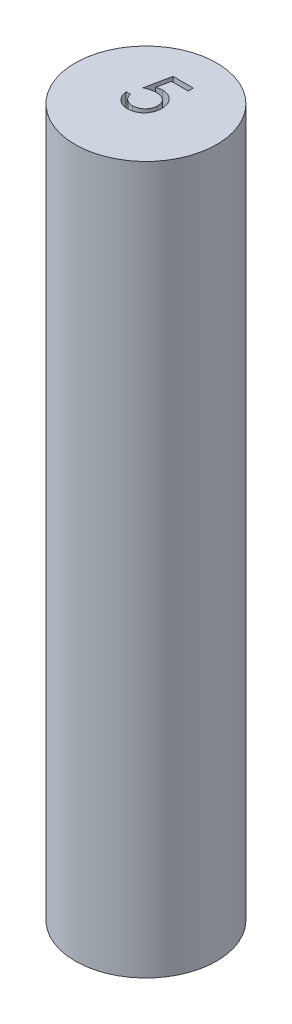
ISO-10303-21;
HEADER;
FILE_DESCRIPTION(('STEP AP214'),'2;1');
FILE_NAME('part.step','',(''),(''),'','','');
FILE_SCHEMA(('AUTOMOTIVE_DESIGN { 1 0 10303 214 1 1 1 1 }'));
ENDSEC;
DATA;
#1=APPLICATION_CONTEXT('core data for automotive mechanical design processes');
#2=APPLICATION_PROTOCOL_DEFINITION('international standard','automotive_design',2000,#1);
#3=PRODUCT_CONTEXT('',#1,'mechanical');
#4=PRODUCT('Part','Part','',(#3));
#5=PRODUCT_RELATED_PRODUCT_CATEGORY('part','',(#4));
#6=PRODUCT_DEFINITION_FORMATION('','',#4);
#7=PRODUCT_DEFINITION_CONTEXT('part definition',#1,'design');
#8=PRODUCT_DEFINITION('design','',#6,#7);
#9=PRODUCT_DEFINITION_SHAPE('','',#8);
#10=(LENGTH_UNIT() NAMED_UNIT(*) SI_UNIT(.MILLI.,.METRE.));
#11=(NAMED_UNIT(*) PLANE_ANGLE_UNIT() SI_UNIT($,.RADIAN.));
#12=(NAMED_UNIT(*) SI_UNIT($,.STERADIAN.) SOLID_ANGLE_UNIT());
#13=UNCERTAINTY_MEASURE_WITH_UNIT(LENGTH_MEASURE(1.E-05),#10,'distance_accuracy_value','');
#14=(GEOMETRIC_REPRESENTATION_CONTEXT(3) GLOBAL_UNCERTAINTY_ASSIGNED_CONTEXT((#13)) GLOBAL_UNIT_ASSIGNED_CONTEXT((#10,
#11,#12)) REPRESENTATION_CONTEXT('',''));
#15=CARTESIAN_POINT('',(0.,0.,0.));
#16=DIRECTION('',(0.,0.,1.));
#17=DIRECTION('',(1.,0.,0.));
#18=AXIS2_PLACEMENT_3D('',#15,#16,#17);
#19=CARTESIAN_POINT('',(0.,50.,0.));
#20=DIRECTION('',(0.,1.,0.));
#21=DIRECTION('',(0.,0.,1.));
#22=AXIS2_PLACEMENT_3D('',#19,#20,#21);
#23=PLANE('',#22);
#24=CARTESIAN_POINT('',(0.,50.,0.));
#25=DIRECTION('',(0.,1.,0.));
#26=DIRECTION('',(0.,0.,1.));
#27=AXIS2_PLACEMENT_3D('',#24,#25,#26);
#28=CIRCLE('',#27,5.);
#29=CARTESIAN_POINT('',(0.,50.,5.));
#30=VERTEX_POINT('',#29);
#31=EDGE_CURVE('E11',#30,#30,#28,.T.);
#32=ORIENTED_EDGE('',*,*,#31,.T.);
#33=EDGE_LOOP('',(#32));
#34=FACE_BOUND('',#33,.T.);
#35=DIRECTION('',(0.200944143721331,0.,-0.97960270064149));
#36=VECTOR('',#35,1.);
#37=CARTESIAN_POINT('',(-1.07623659228629,50.,-0.881935528420076));
#38=LINE('',#37,#36);
#39=CARTESIAN_POINT('',(-1.07623659228629,50.,-0.881935528420076));
#40=VERTEX_POINT('',#39);
#41=CARTESIAN_POINT('',(-0.717262233311934,50.,-2.63193552842008));
#42=VERTEX_POINT('',#41);
#43=EDGE_CURVE('E279',#40,#42,#38,.T.);
#44=ORIENTED_EDGE('',*,*,#43,.T.);
#45=DIRECTION('',(1.,0.,0.));
#46=VECTOR('',#45,1.);
#47=CARTESIAN_POINT('',(-0.717262233311933,50.,-2.63193552842008));
#48=LINE('',#47,#46);
#49=CARTESIAN_POINT('',(0.718635202585503,50.,-2.63193552842008));
#50=VERTEX_POINT('',#49);
#51=EDGE_CURVE('E55',#42,#50,#48,.T.);
#52=ORIENTED_EDGE('',*,*,#51,.T.);
#53=DIRECTION('',(0.,0.,1.));
#54=VECTOR('',#53,1.);
#55=CARTESIAN_POINT('',(0.718635202585503,50.,-2.63193552842008));
#56=LINE('',#55,#54);
#57=CARTESIAN_POINT('',(0.718635202585503,50.,-2.27296116944572));
#58=VERTEX_POINT('',#57);
#59=EDGE_CURVE('E376',#50,#58,#56,.T.);
#60=ORIENTED_EDGE('',*,*,#59,.T.);
#61=DIRECTION('',(-1.,0.,0.));
#62=VECTOR('',#61,1.);
#63=CARTESIAN_POINT('',(0.718635202585503,50.,-2.27296116944572));
#64=LINE('',#63,#62);
#65=CARTESIAN_POINT('',(-0.471869605106805,50.,-2.27296116944572));
#66=VERTEX_POINT('',#65);
#67=EDGE_CURVE('E372',#58,#66,#64,.T.);
#68=ORIENTED_EDGE('',*,*,#67,.T.);
#69=DIRECTION('',(-0.200705474463135,0.,0.979651628141621));
#70=VECTOR('',#69,1.);
#71=CARTESIAN_POINT('',(-0.471869605106805,50.,-2.27296116944572));
#72=LINE('',#71,#70);
#73=CARTESIAN_POINT('',(-0.660471367927318,50.,-1.35238825277905));
#74=VERTEX_POINT('',#73);
#75=EDGE_CURVE('E364',#66,#74,#72,.T.);
#76=ORIENTED_EDGE('',*,*,#75,.T.);
#77=CARTESIAN_POINT('',(-0.660471367927318,50.,-1.35238825277905));
#78=CARTESIAN_POINT('',(-0.62341549355365,50.,-1.36261852458931));
#79=CARTESIAN_POINT('',(-0.551625597721274,50.,-1.38243805819927));
#80=CARTESIAN_POINT('',(-0.445665736757551,50.,-1.40444382862876));
#81=CARTESIAN_POINT('',(-0.34507353328656,50.,-1.41770927268624));
#82=CARTESIAN_POINT('',(-0.279798162876054,50.,-1.41952058319843));
#83=CARTESIAN_POINT('',(-0.248211752542703,50.,-1.42039706688161));
#84=B_SPLINE_CURVE_WITH_KNOTS('',3,(#77,#78,#79,#80,#81,#82,#83),.UNSPECIFIED.,.F.,.F.,(4,1,1,1,
4),(0.,0.275068369018743,0.532901460089936,0.773973459592445,1.),.UNSPECIFIED.);
#85=CARTESIAN_POINT('',(-0.248211752542703,50.,-1.42039706688161));
#86=VERTEX_POINT('',#85);
#87=EDGE_CURVE('E371',#74,#86,#84,.T.);
#88=ORIENTED_EDGE('',*,*,#87,.T.);
#89=CARTESIAN_POINT('',(-0.248211752542703,50.,-1.42039706688161));
#90=CARTESIAN_POINT('',(-0.209128012830501,50.,-1.41955113118697));
#91=CARTESIAN_POINT('',(-0.132279615505371,50.,-1.41788781025474));
#92=CARTESIAN_POINT('',(-0.0198406685117425,50.,-1.40191596081044));
#93=CARTESIAN_POINT('',(0.0874922247063756,50.,-1.37677604618019));
#94=CARTESIAN_POINT('',(0.189494594882724,50.,-1.34165552444349));
#95=CARTESIAN_POINT('',(0.286355145520003,50.,-1.29674579124916));
#96=CARTESIAN_POINT('',(0.377182707000526,50.,-1.24064585089134));
#97=CARTESIAN_POINT('',(0.463340619987352,50.,-1.17511251974169));
#98=CARTESIAN_POINT('',(0.543283213941527,50.,-1.09976750778208));
#99=CARTESIAN_POINT('',(0.615807522106947,50.,-1.01684589102991));
#100=CARTESIAN_POINT('',(0.679573511773929,50.,-0.927688019986427));
#101=CARTESIAN_POINT('',(0.733736102078204,50.,-0.83316035785185));
#102=CARTESIAN_POINT('',(0.777296856954626,50.,-0.732359749113633));
#103=CARTESIAN_POINT('',(0.812081191230572,50.,-0.62640059570326));
#104=CARTESIAN_POINT('',(0.835233186074378,50.,-0.514168013151016));
#105=CARTESIAN_POINT('',(0.850649895035669,50.,-0.396719893137636));
#106=CARTESIAN_POINT('',(0.852372281355253,50.,-0.316415323060459));
#107=CARTESIAN_POINT('',(0.853250587200887,50.,-0.275465175855973));
#108=B_SPLINE_CURVE_WITH_KNOTS('',3,(#89,#90,#91,#92,#93,#94,#95,#96,#97,#98,#99,#100,#101,#102,
#103,#104,#105,#106,#107),.UNSPECIFIED.,.F.,.F.,(4,1,1,1,1,1,1,1,1,1,1,1,1,1,1,1,4),(0.,
0.0658076458106948,0.129394273668056,0.19089406063219,0.251281068929836,0.310814964465273,
0.370370987448245,0.430768262589727,0.492881250617502,0.55510394815525,0.616067050993843,
0.677256033174654,0.738259805199117,0.800762134376296,0.864777581574485,0.931045294999404,1.),.UNSPECIFIED.);
#109=CARTESIAN_POINT('',(0.853250587200887,50.,-0.275465175855973));
#110=VERTEX_POINT('',#109);
#111=EDGE_CURVE('E387',#86,#110,#108,.T.);
#112=ORIENTED_EDGE('',*,*,#111,.T.);
#113=CARTESIAN_POINT('',(0.853250587200887,50.,-0.275465175855973));
#114=CARTESIAN_POINT('',(0.852585511927517,50.,-0.246942955504013));
#115=CARTESIAN_POINT('',(0.851264349297613,50.,-0.190283967928169));
#116=CARTESIAN_POINT('',(0.844545761649825,50.,-0.106139767242871));
#117=CARTESIAN_POINT('',(0.831610045585646,50.,-0.0237769341605294));
#118=CARTESIAN_POINT('',(0.814242321481598,50.,0.0568154576781773));
#119=CARTESIAN_POINT('',(0.791699903516092,50.,0.1354848298573));
#120=CARTESIAN_POINT('',(0.764410849613766,50.,0.212456357784072));
#121=CARTESIAN_POINT('',(0.731014822103908,50.,0.287250964527232));
#122=CARTESIAN_POINT('',(0.694383446844984,50.,0.360576359551009));
#123=CARTESIAN_POINT('',(0.653136968809668,50.,0.430774866745728));
#124=CARTESIAN_POINT('',(0.607358461470707,50.,0.496423853288414));
#125=CARTESIAN_POINT('',(0.558992970248379,50.,0.558508134768357));
#126=CARTESIAN_POINT('',(0.506951584790099,50.,0.616361867777545));
#127=CARTESIAN_POINT('',(0.450750589677504,50.,0.669604885670543));
#128=CARTESIAN_POINT('',(0.391070622815796,50.,0.718553167176471));
#129=CARTESIAN_POINT('',(0.32838790378667,50.,0.764034497479565));
#130=CARTESIAN_POINT('',(0.261732661465713,50.,0.804202692655071));
#131=CARTESIAN_POINT('',(0.192590178502148,50.,0.841165648807863));
#132=CARTESIAN_POINT('',(0.119961961361665,50.,0.871489186143206));
#133=CARTESIAN_POINT('',(0.0455012609041593,50.,0.898599714228155));
#134=CARTESIAN_POINT('',(-0.0318636146906746,50.,0.920209241839751));
#135=CARTESIAN_POINT('',(-0.111957427306437,50.,0.937141796359078));
#136=CARTESIAN_POINT('',(-0.194912202788528,50.,0.948642396961549));
#137=CARTESIAN_POINT('',(-0.280292872812277,50.,0.957018834431784));
#138=CARTESIAN_POINT('',(-0.338167885392149,50.,0.957543191382416));
#139=CARTESIAN_POINT('',(-0.367402457670908,50.,0.957808061323514));
#140=B_SPLINE_CURVE_WITH_KNOTS('',3,(#113,#114,#115,#116,#117,#118,#119,#120,#121,#122,#123,
#124,#125,#126,#127,#128,#129,#130,#131,#132,#133,#134,#135,#136,#137,#138,#139),.UNSPECIFIED.,
.F.,.F.,(4,1,1,1,1,1,1,1,1,1,1,1,1,1,1,1,1,1,1,1,1,1,1,1,4),(0.,0.04401447057614,
0.0874341236677057,0.130118398657898,0.172553694558183,0.214554755968139,0.256298092097131,
0.29843822513325,0.340849002588096,0.382715188967027,0.423924045407532,0.464246243250418,
0.504073671461796,0.543861905868491,0.583566724979654,0.623094318852334,0.663229060768585,
0.70355125861147,0.743937894686185,0.784541254800093,0.825750111240597,0.867757363388507,
0.91074516403231,0.954914446891478,1.),.UNSPECIFIED.);
#141=CARTESIAN_POINT('',(-0.367402457670908,50.,0.957808061323514));
#142=VERTEX_POINT('',#141);
#143=EDGE_CURVE('E396',#110,#142,#140,.T.);
#144=ORIENTED_EDGE('',*,*,#143,.T.);
#145=CARTESIAN_POINT('',(-0.367402457670908,50.,0.957808061323514));
#146=CARTESIAN_POINT('',(-0.402276638373117,50.,0.957117223339353));
#147=CARTESIAN_POINT('',(-0.470887469077004,50.,0.955758081216996));
#148=CARTESIAN_POINT('',(-0.571408036148568,50.,0.941539595962919));
#149=CARTESIAN_POINT('',(-0.66812264184203,50.,0.921175679570378));
#150=CARTESIAN_POINT('',(-0.760252742999452,50.,0.890539409722026));
#151=CARTESIAN_POINT('',(-0.84862400670469,50.,0.852152115031805));
#152=CARTESIAN_POINT('',(-0.932046724493541,50.,0.803635943536381));
#153=CARTESIAN_POINT('',(-1.01265250054141,50.,0.748656839789333));
#154=CARTESIAN_POINT('',(-1.08716453729091,50.,0.683776486824548));
#155=CARTESIAN_POINT('',(-1.15632065076056,50.,0.612860804792037));
#156=CARTESIAN_POINT('',(-1.21822715963089,50.,0.535903163626293));
#157=CARTESIAN_POINT('',(-1.27336073636755,50.,0.454173721540196));
#158=CARTESIAN_POINT('',(-1.3208384833564,50.,0.367275567464477));
#159=CARTESIAN_POINT('',(-1.36133650467279,50.,0.27543703652684));
#160=CARTESIAN_POINT('',(-1.3931514929495,50.,0.178314035634898));
#161=CARTESIAN_POINT('',(-1.41882984789262,50.,0.0764140316954972));
#162=CARTESIAN_POINT('',(-1.42969326836897,50.,0.00626052128496388));
#163=CARTESIAN_POINT('',(-1.43521095126065,50.,-0.0293714258559734));
#164=B_SPLINE_CURVE_WITH_KNOTS('',3,(#145,#146,#147,#148,#149,#150,#151,#152,#153,#154,#155,
#156,#157,#158,#159,#160,#161,#162,#163),.UNSPECIFIED.,.F.,.F.,(4,1,1,1,1,1,1,1,1,1,1,1,1,1,1,1,
4),(0.,0.0654211437588925,0.128708371881883,0.190236141863538,0.250724402033539,
0.310637179413444,0.370766408289727,0.431614744412353,0.493522973566354,0.555883455377533,
0.61734236731851,0.678668039097275,0.740711359545148,0.802985362512745,0.866802580265518,
0.932347171345888,1.),.UNSPECIFIED.);
#165=CARTESIAN_POINT('',(-1.43521095126065,50.,-0.0293714258559734));
#166=VERTEX_POINT('',#165);
#167=EDGE_CURVE('E405',#142,#166,#164,.T.);
#168=ORIENTED_EDGE('',*,*,#167,.T.);
#169=DIRECTION('',(1.,0.,0.));
#170=VECTOR('',#169,1.);
#171=CARTESIAN_POINT('',(-1.43521095126065,50.,-0.0293714258559734));
#172=LINE('',#171,#170);
#173=CARTESIAN_POINT('',(-1.12110838715809,50.,-0.0293714258559734));
#174=VERTEX_POINT('',#173);
#175=EDGE_CURVE('E414',#166,#174,#172,.T.);
#176=ORIENTED_EDGE('',*,*,#175,.T.);
#177=CARTESIAN_POINT('',(-1.12110838715809,50.,-0.0293714258559734));
#178=CARTESIAN_POINT('',(-1.11337982976792,50.,0.00400502659267852));
#179=CARTESIAN_POINT('',(-1.09852511332705,50.,0.0681564214646408));
#180=CARTESIAN_POINT('',(-1.06591936457507,50.,0.158287762797713));
#181=CARTESIAN_POINT('',(-1.02605348910235,50.,0.238606986473723));
#182=CARTESIAN_POINT('',(-0.978649140685077,50.,0.31017656974727));
#183=CARTESIAN_POINT('',(-0.922099110198855,50.,0.37258556701958));
#184=CARTESIAN_POINT('',(-0.857569681258205,50.,0.428202628957347));
#185=CARTESIAN_POINT('',(-0.785221958058977,50.,0.478377758284881));
#186=CARTESIAN_POINT('',(-0.704828728539082,50.,0.520200525482194));
#187=CARTESIAN_POINT('',(-0.620015649218712,50.,0.555869278882219));
#188=CARTESIAN_POINT('',(-0.531248439209124,50.,0.57962097383389));
#189=CARTESIAN_POINT('',(-0.440944092738035,50.,0.596321866676701));
#190=CARTESIAN_POINT('',(-0.379865722541538,50.,0.597993627478355));
#191=CARTESIAN_POINT('',(-0.349173291004241,50.,0.598833702349155));
#192=B_SPLINE_CURVE_WITH_KNOTS('',3,(#177,#178,#179,#180,#181,#182,#183,#184,#185,#186,#187,
#188,#189,#190,#191),.UNSPECIFIED.,.F.,.F.,(4,1,1,1,1,1,1,1,1,1,1,1,4),(0.,0.0946872518675539,
0.181994155707275,0.264376948610512,0.342179861947772,0.418617610862147,0.496509075371909,
0.577369091611732,0.661510592454198,0.746732550829197,0.831257984327743,0.915205616213655,1.),.UNSPECIFIED.);
#193=CARTESIAN_POINT('',(-0.349173291004241,50.,0.598833702349155));
#194=VERTEX_POINT('',#193);
#195=EDGE_CURVE('E421',#174,#194,#192,.T.);
#196=ORIENTED_EDGE('',*,*,#195,.T.);
#197=CARTESIAN_POINT('',(-0.349173291004241,50.,0.598833702349155));
#198=CARTESIAN_POINT('',(-0.319214846586953,50.,0.598012924444051));
#199=CARTESIAN_POINT('',(-0.260226424398379,50.,0.596396806032998));
#200=CARTESIAN_POINT('',(-0.173415037705375,50.,0.583957793943144));
#201=CARTESIAN_POINT('',(-0.0896021635032361,50.,0.564800222635528));
#202=CARTESIAN_POINT('',(-0.00961480674427134,50.,0.536130367651756));
#203=CARTESIAN_POINT('',(0.067946732844773,50.,0.501285649225945));
#204=CARTESIAN_POINT('',(0.141120503267869,50.,0.456570573410066));
#205=CARTESIAN_POINT('',(0.212023380408537,50.,0.405110554965058));
#206=CARTESIAN_POINT('',(0.27845151392959,50.,0.346153924921672));
#207=CARTESIAN_POINT('',(0.339290963189144,50.,0.28118423030242));
#208=CARTESIAN_POINT('',(0.393047084323063,50.,0.211706836877508));
#209=CARTESIAN_POINT('',(0.437823997749215,50.,0.137589990334633));
#210=CARTESIAN_POINT('',(0.475558106618903,50.,0.060116837483714));
#211=CARTESIAN_POINT('',(0.504211405441535,50.,-0.021561719694731));
#212=CARTESIAN_POINT('',(0.524652386664338,50.,-0.107062894867154));
#213=CARTESIAN_POINT('',(0.536655445482834,50.,-0.196597875073582));
#214=CARTESIAN_POINT('',(0.538306625454802,50.,-0.257667184849802));
#215=CARTESIAN_POINT('',(0.539148023098323,50.,-0.288786489958537));
#216=B_SPLINE_CURVE_WITH_KNOTS('',3,(#197,#198,#199,#200,#201,#202,#203,#204,#205,#206,#207,
#208,#209,#210,#211,#212,#213,#214,#215),.UNSPECIFIED.,.F.,.F.,(4,1,1,1,1,1,1,1,1,1,1,1,1,1,1,1,
4),(0.,0.0642072952829856,0.126424689779743,0.187680284264922,0.248216424455213,
0.308305060008613,0.369660991325143,0.43169855178678,0.495946892208764,0.55975802397212,
0.622295407826159,0.683910635284174,0.745092408056624,0.806740225389293,0.869086618121202,
0.933290002974799,1.),.UNSPECIFIED.);
#217=CARTESIAN_POINT('',(0.539148023098323,50.,-0.288786489958537));
#218=VERTEX_POINT('',#217);
#219=EDGE_CURVE('E427',#194,#218,#216,.T.);
#220=ORIENTED_EDGE('',*,*,#219,.T.);
#221=CARTESIAN_POINT('',(0.539148023098323,50.,-0.288786489958537));
#222=CARTESIAN_POINT('',(0.538489543636872,50.,-0.316862241579735));
#223=CARTESIAN_POINT('',(0.537200663782479,50.,-0.371816530634923));
#224=CARTESIAN_POINT('',(0.526670093479521,50.,-0.452215737076165));
#225=CARTESIAN_POINT('',(0.50835312112582,50.,-0.528288779377761));
#226=CARTESIAN_POINT('',(0.48292924117886,50.,-0.600403013349724));
#227=CARTESIAN_POINT('',(0.450649733445259,50.,-0.668626455697758));
#228=CARTESIAN_POINT('',(0.411203421126436,50.,-0.733029515897957));
#229=CARTESIAN_POINT('',(0.363850023182933,50.,-0.792763349121439));
#230=CARTESIAN_POINT('',(0.309758134594269,50.,-0.847855902730945));
#231=CARTESIAN_POINT('',(0.250500093651186,50.,-0.898700777604049));
#232=CARTESIAN_POINT('',(0.185056351054059,50.,-0.942044864055998));
#233=CARTESIAN_POINT('',(0.11479642425891,50.,-0.978508781707828));
#234=CARTESIAN_POINT('',(0.0405668247900537,50.,-1.00997678005059));
#235=CARTESIAN_POINT('',(-0.039398073797348,50.,-1.03257752544993));
#236=CARTESIAN_POINT('',(-0.123514706176746,50.,-1.04954541089203));
#237=CARTESIAN_POINT('',(-0.212691414123702,50.,-1.05936077357029));
#238=CARTESIAN_POINT('',(-0.273662102257656,50.,-1.06072266194604));
#239=CARTESIAN_POINT('',(-0.305002617927318,50.,-1.06142270790726));
#240=B_SPLINE_CURVE_WITH_KNOTS('',3,(#221,#222,#223,#224,#225,#226,#227,#228,#229,#230,#231,
#232,#233,#234,#235,#236,#237,#238,#239),.UNSPECIFIED.,.F.,.F.,(4,1,1,1,1,1,1,1,1,1,1,1,1,1,1,1,
4),(0.,0.0653513820265936,0.127916031830613,0.1883602055717,0.247216077265452,0.305630129197411,
0.363769839831819,0.42266091391278,0.482687294090392,0.543300221239559,0.604117955323103,
0.664964891265284,0.727413494112565,0.791467625149424,0.8580554427291,0.927036814614948,1.),.UNSPECIFIED.);
#241=CARTESIAN_POINT('',(-0.305002617927318,50.,-1.06142270790726));
#242=VERTEX_POINT('',#241);
#243=EDGE_CURVE('E286',#218,#242,#240,.T.);
#244=ORIENTED_EDGE('',*,*,#243,.T.);
#245=CARTESIAN_POINT('',(-0.305002617927318,50.,-1.06142270790726));
#246=CARTESIAN_POINT('',(-0.332131546733742,50.,-1.06084211674967));
#247=CARTESIAN_POINT('',(-0.388145902058445,50.,-1.05964334330634));
#248=CARTESIAN_POINT('',(-0.474068728787708,50.,-1.05081684648001));
#249=CARTESIAN_POINT('',(-0.564360451764435,50.,-1.03657755205187));
#250=CARTESIAN_POINT('',(-0.658674947320635,50.,-1.01699130458269));
#251=CARTESIAN_POINT('',(-0.757295455423644,50.,-0.991360227824061));
#252=CARTESIAN_POINT('',(-0.860013856150918,50.,-0.960645727198498));
#253=CARTESIAN_POINT('',(-0.967046122750207,50.,-0.923923728484904));
#254=CARTESIAN_POINT('',(-1.03916384714895,50.,-0.896191514738229));
#255=CARTESIAN_POINT('',(-1.07623659228629,50.,-0.881935528420076));
#256=B_SPLINE_CURVE_WITH_KNOTS('',3,(#245,#246,#247,#248,#249,#250,#251,#252,#253,#254,#255),
.UNSPECIFIED.,.F.,.F.,(4,1,1,1,1,1,1,1,4),(0.,0.10220303703522,0.211023342373876,
0.325099661565208,0.446502097134889,0.573787717648856,0.708900709766066,0.850357871293401,1.),.UNSPECIFIED.);
#257=EDGE_CURVE('E166',#242,#40,#256,.T.);
#258=ORIENTED_EDGE('',*,*,#257,.T.);
#259=EDGE_LOOP('',(#44,#52,#60,#68,#76,#88,#112,#144,#168,#176,#196,#220,#244,#258));
#260=FACE_BOUND('',#259,.T.);
#261=ADVANCED_FACE('F39',(#34,#260),#23,.T.);
#262=CARTESIAN_POINT('',(0.,50.,0.));
#263=DIRECTION('',(0.,-1.,0.));
#264=DIRECTION('',(0.,0.,-1.));
#265=AXIS2_PLACEMENT_3D('',#262,#263,#264);
#266=CYLINDRICAL_SURFACE('',#265,5.);
#267=ORIENTED_EDGE('',*,*,#31,.F.);
#268=EDGE_LOOP('',(#267));
#269=FACE_BOUND('',#268,.T.);
#270=CARTESIAN_POINT('',(0.,0.,0.));
#271=DIRECTION('',(0.,1.,0.));
#272=DIRECTION('',(0.,0.,1.));
#273=AXIS2_PLACEMENT_3D('',#270,#271,#272);
#274=CIRCLE('',#273,5.);
#275=CARTESIAN_POINT('',(0.,0.,5.));
#276=VERTEX_POINT('',#275);
#277=EDGE_CURVE('E43',#276,#276,#274,.T.);
#278=ORIENTED_EDGE('',*,*,#277,.T.);
#279=EDGE_LOOP('',(#278));
#280=FACE_BOUND('',#279,.T.);
#281=ADVANCED_FACE('F41',(#269,#280),#266,.T.);
#282=CARTESIAN_POINT('',(0.,0.,0.));
#283=DIRECTION('',(0.,1.,0.));
#284=DIRECTION('',(0.,0.,1.));
#285=AXIS2_PLACEMENT_3D('',#282,#283,#284);
#286=PLANE('',#285);
#287=ORIENTED_EDGE('',*,*,#277,.F.);
#288=EDGE_LOOP('',(#287));
#289=FACE_BOUND('',#288,.T.);
#290=ADVANCED_FACE('F332',(#289),#286,.F.);
#291=CARTESIAN_POINT('',(-0.717262233311933,47.,-2.63193552842008));
#292=DIRECTION('',(0.,0.,1.));
#293=DIRECTION('',(1.,0.,0.));
#294=AXIS2_PLACEMENT_3D('',#291,#292,#293);
#295=PLANE('',#294);
#296=ORIENTED_EDGE('',*,*,#51,.F.);
#297=DIRECTION('',(0.,1.,0.));
#298=VECTOR('',#297,1.);
#299=CARTESIAN_POINT('',(-0.717262233311933,47.,-2.63193552842008));
#300=LINE('',#299,#298);
#301=CARTESIAN_POINT('',(-0.717262233311933,47.,-2.63193552842008));
#302=VERTEX_POINT('',#301);
#303=EDGE_CURVE('E174',#302,#42,#300,.T.);
#304=ORIENTED_EDGE('',*,*,#303,.F.);
#305=DIRECTION('',(1.,0.,0.));
#306=VECTOR('',#305,1.);
#307=CARTESIAN_POINT('',(-0.717262233311933,47.,-2.63193552842008));
#308=LINE('',#307,#306);
#309=CARTESIAN_POINT('',(0.718635202585503,47.,-2.63193552842008));
#310=VERTEX_POINT('',#309);
#311=EDGE_CURVE('E277',#302,#310,#308,.T.);
#312=ORIENTED_EDGE('',*,*,#311,.T.);
#313=DIRECTION('',(0.,1.,0.));
#314=VECTOR('',#313,1.);
#315=CARTESIAN_POINT('',(0.718635202585503,47.,-2.63193552842008));
#316=LINE('',#315,#314);
#317=EDGE_CURVE('E325',#310,#50,#316,.T.);
#318=ORIENTED_EDGE('',*,*,#317,.T.);
#319=EDGE_LOOP('',(#296,#304,#312,#318));
#320=FACE_BOUND('',#319,.T.);
#321=ADVANCED_FACE('F334',(#320),#295,.T.);
#322=CARTESIAN_POINT('',(0.718635202585503,47.,-2.63193552842008));
#323=DIRECTION('',(-1.,0.,0.));
#324=DIRECTION('',(0.,0.,1.));
#325=AXIS2_PLACEMENT_3D('',#322,#323,#324);
#326=PLANE('',#325);
#327=ORIENTED_EDGE('',*,*,#59,.F.);
#328=ORIENTED_EDGE('',*,*,#317,.F.);
#329=DIRECTION('',(0.,0.,1.));
#330=VECTOR('',#329,1.);
#331=CARTESIAN_POINT('',(0.718635202585503,47.,-2.63193552842008));
#332=LINE('',#331,#330);
#333=CARTESIAN_POINT('',(0.718635202585503,47.,-2.27296116944572));
#334=VERTEX_POINT('',#333);
#335=EDGE_CURVE('E118',#310,#334,#332,.T.);
#336=ORIENTED_EDGE('',*,*,#335,.T.);
#337=DIRECTION('',(0.,1.,0.));
#338=VECTOR('',#337,1.);
#339=CARTESIAN_POINT('',(0.718635202585503,47.,-2.27296116944572));
#340=LINE('',#339,#338);
#341=EDGE_CURVE('E322',#334,#58,#340,.T.);
#342=ORIENTED_EDGE('',*,*,#341,.T.);
#343=EDGE_LOOP('',(#327,#328,#336,#342));
#344=FACE_BOUND('',#343,.T.);
#345=ADVANCED_FACE('F339',(#344),#326,.T.);
#346=CARTESIAN_POINT('',(0.718635202585503,47.,-2.27296116944572));
#347=DIRECTION('',(0.,0.,-1.));
#348=DIRECTION('',(-1.,0.,0.));
#349=AXIS2_PLACEMENT_3D('',#346,#347,#348);
#350=PLANE('',#349);
#351=ORIENTED_EDGE('',*,*,#67,.F.);
#352=ORIENTED_EDGE('',*,*,#341,.F.);
#353=DIRECTION('',(-1.,0.,0.));
#354=VECTOR('',#353,1.);
#355=CARTESIAN_POINT('',(0.718635202585503,47.,-2.27296116944572));
#356=LINE('',#355,#354);
#357=CARTESIAN_POINT('',(-0.471869605106805,47.,-2.27296116944572));
#358=VERTEX_POINT('',#357);
#359=EDGE_CURVE('E272',#334,#358,#356,.T.);
#360=ORIENTED_EDGE('',*,*,#359,.T.);
#361=DIRECTION('',(0.,1.,0.));
#362=VECTOR('',#361,1.);
#363=CARTESIAN_POINT('',(-0.471869605106805,47.,-2.27296116944572));
#364=LINE('',#363,#362);
#365=EDGE_CURVE('E319',#358,#66,#364,.T.);
#366=ORIENTED_EDGE('',*,*,#365,.T.);
#367=EDGE_LOOP('',(#351,#352,#360,#366));
#368=FACE_BOUND('',#367,.T.);
#369=ADVANCED_FACE('F350',(#368),#350,.T.);
#370=CARTESIAN_POINT('',(-0.471869605106805,47.,-2.27296116944572));
#371=DIRECTION('',(-0.97965162814162,0.,-0.200705474463135));
#372=DIRECTION('',(-0.200705474463135,0.,0.979651628141621));
#373=AXIS2_PLACEMENT_3D('',#370,#371,#372);
#374=PLANE('',#373);
#375=ORIENTED_EDGE('',*,*,#75,.F.);
#376=ORIENTED_EDGE('',*,*,#365,.F.);
#377=DIRECTION('',(-0.200705474463135,0.,0.979651628141621));
#378=VECTOR('',#377,1.);
#379=CARTESIAN_POINT('',(-0.471869605106805,47.,-2.27296116944572));
#380=LINE('',#379,#378);
#381=CARTESIAN_POINT('',(-0.660471367927318,47.,-1.35238825277905));
#382=VERTEX_POINT('',#381);
#383=EDGE_CURVE('E266',#358,#382,#380,.T.);
#384=ORIENTED_EDGE('',*,*,#383,.T.);
#385=DIRECTION('',(0.,1.,0.));
#386=VECTOR('',#385,1.);
#387=CARTESIAN_POINT('',(-0.660471367927318,47.,-1.35238825277905));
#388=LINE('',#387,#386);
#389=EDGE_CURVE('E316',#382,#74,#388,.T.);
#390=ORIENTED_EDGE('',*,*,#389,.T.);
#391=EDGE_LOOP('',(#375,#376,#384,#390));
#392=FACE_BOUND('',#391,.T.);
#393=ADVANCED_FACE('F353',(#392),#374,.T.);
#394=CARTESIAN_POINT('',(-0.660471367927318,47.,-1.35238825277905));
#395=CARTESIAN_POINT('',(-0.62341549355365,47.,-1.36261852458931));
#396=CARTESIAN_POINT('',(-0.551625597721274,47.,-1.38243805819927));
#397=CARTESIAN_POINT('',(-0.445665736757551,47.,-1.40444382862876));
#398=CARTESIAN_POINT('',(-0.34507353328656,47.,-1.41770927268624));
#399=CARTESIAN_POINT('',(-0.279798162876054,47.,-1.41952058319843));
#400=CARTESIAN_POINT('',(-0.248211752542703,47.,-1.42039706688161));
#401=B_SPLINE_CURVE_WITH_KNOTS('',3,(#394,#395,#396,#397,#398,#399,#400),.UNSPECIFIED.,.F.,.F.,
(4,1,1,1,4),(0.,0.275068369018743,0.532901460089936,0.773973459592445,1.),.UNSPECIFIED.);
#402=DIRECTION('',(0.,1.,0.));
#403=VECTOR('',#402,1.);
#404=SURFACE_OF_LINEAR_EXTRUSION('',#401,#403);
#405=ORIENTED_EDGE('',*,*,#87,.F.);
#406=ORIENTED_EDGE('',*,*,#389,.F.);
#407=CARTESIAN_POINT('',(-0.248211752542703,47.,-1.42039706688161));
#408=VERTEX_POINT('',#407);
#409=EDGE_CURVE('E257',#382,#408,#401,.T.);
#410=ORIENTED_EDGE('',*,*,#409,.T.);
#411=DIRECTION('',(0.,1.,0.));
#412=VECTOR('',#411,1.);
#413=CARTESIAN_POINT('',(-0.248211752542703,47.,-1.42039706688161));
#414=LINE('',#413,#412);
#415=EDGE_CURVE('E313',#408,#86,#414,.T.);
#416=ORIENTED_EDGE('',*,*,#415,.T.);
#417=EDGE_LOOP('',(#405,#406,#410,#416));
#418=FACE_BOUND('',#417,.T.);
#419=ADVANCED_FACE('F248',(#418),#404,.T.);
#420=CARTESIAN_POINT('',(-0.248211752542703,47.,-1.42039706688161));
#421=CARTESIAN_POINT('',(-0.209128012830501,47.,-1.41955113118697));
#422=CARTESIAN_POINT('',(-0.132279615505371,47.,-1.41788781025474));
#423=CARTESIAN_POINT('',(-0.0198406685117425,47.,-1.40191596081044));
#424=CARTESIAN_POINT('',(0.0874922247063756,47.,-1.37677604618019));
#425=CARTESIAN_POINT('',(0.189494594882724,47.,-1.34165552444349));
#426=CARTESIAN_POINT('',(0.286355145520003,47.,-1.29674579124916));
#427=CARTESIAN_POINT('',(0.377182707000526,47.,-1.24064585089134));
#428=CARTESIAN_POINT('',(0.463340619987352,47.,-1.17511251974169));
#429=CARTESIAN_POINT('',(0.543283213941527,47.,-1.09976750778208));
#430=CARTESIAN_POINT('',(0.615807522106947,47.,-1.01684589102991));
#431=CARTESIAN_POINT('',(0.679573511773929,47.,-0.927688019986427));
#432=CARTESIAN_POINT('',(0.733736102078204,47.,-0.83316035785185));
#433=CARTESIAN_POINT('',(0.777296856954626,47.,-0.732359749113633));
#434=CARTESIAN_POINT('',(0.812081191230572,47.,-0.62640059570326));
#435=CARTESIAN_POINT('',(0.835233186074378,47.,-0.514168013151016));
#436=CARTESIAN_POINT('',(0.850649895035669,47.,-0.396719893137636));
#437=CARTESIAN_POINT('',(0.852372281355253,47.,-0.316415323060459));
#438=CARTESIAN_POINT('',(0.853250587200887,47.,-0.275465175855973));
#439=B_SPLINE_CURVE_WITH_KNOTS('',3,(#420,#421,#422,#423,#424,#425,#426,#427,#428,#429,#430,
#431,#432,#433,#434,#435,#436,#437,#438),.UNSPECIFIED.,.F.,.F.,(4,1,1,1,1,1,1,1,1,1,1,1,1,1,1,1,
4),(0.,0.0658076458106948,0.129394273668056,0.19089406063219,0.251281068929836,
0.310814964465273,0.370370987448245,0.430768262589727,0.492881250617502,0.55510394815525,
0.616067050993843,0.677256033174654,0.738259805199117,0.800762134376296,0.864777581574485,
0.931045294999404,1.),.UNSPECIFIED.);
#440=DIRECTION('',(0.,1.,0.));
#441=VECTOR('',#440,1.);
#442=SURFACE_OF_LINEAR_EXTRUSION('',#439,#441);
#443=ORIENTED_EDGE('',*,*,#111,.F.);
#444=ORIENTED_EDGE('',*,*,#415,.F.);
#445=CARTESIAN_POINT('',(0.853250587200887,47.,-0.275465175855973));
#446=VERTEX_POINT('',#445);
#447=EDGE_CURVE('E252',#408,#446,#439,.T.);
#448=ORIENTED_EDGE('',*,*,#447,.T.);
#449=DIRECTION('',(0.,1.,0.));
#450=VECTOR('',#449,1.);
#451=CARTESIAN_POINT('',(0.853250587200887,47.,-0.275465175855973));
#452=LINE('',#451,#450);
#453=EDGE_CURVE('E310',#446,#110,#452,.T.);
#454=ORIENTED_EDGE('',*,*,#453,.T.);
#455=EDGE_LOOP('',(#443,#444,#448,#454));
#456=FACE_BOUND('',#455,.T.);
#457=ADVANCED_FACE('F244',(#456),#442,.T.);
#458=CARTESIAN_POINT('',(0.853250587200887,47.,-0.275465175855973));
#459=CARTESIAN_POINT('',(0.852585511927517,47.,-0.246942955504013));
#460=CARTESIAN_POINT('',(0.851264349297613,47.,-0.190283967928169));
#461=CARTESIAN_POINT('',(0.844545761649825,47.,-0.106139767242871));
#462=CARTESIAN_POINT('',(0.831610045585646,47.,-0.0237769341605294));
#463=CARTESIAN_POINT('',(0.814242321481598,47.,0.0568154576781773));
#464=CARTESIAN_POINT('',(0.791699903516092,47.,0.1354848298573));
#465=CARTESIAN_POINT('',(0.764410849613766,47.,0.212456357784072));
#466=CARTESIAN_POINT('',(0.731014822103908,47.,0.287250964527232));
#467=CARTESIAN_POINT('',(0.694383446844984,47.,0.360576359551009));
#468=CARTESIAN_POINT('',(0.653136968809668,47.,0.430774866745728));
#469=CARTESIAN_POINT('',(0.607358461470707,47.,0.496423853288414));
#470=CARTESIAN_POINT('',(0.558992970248379,47.,0.558508134768357));
#471=CARTESIAN_POINT('',(0.506951584790099,47.,0.616361867777545));
#472=CARTESIAN_POINT('',(0.450750589677504,47.,0.669604885670543));
#473=CARTESIAN_POINT('',(0.391070622815796,47.,0.718553167176471));
#474=CARTESIAN_POINT('',(0.32838790378667,47.,0.764034497479565));
#475=CARTESIAN_POINT('',(0.261732661465713,47.,0.804202692655071));
#476=CARTESIAN_POINT('',(0.192590178502148,47.,0.841165648807863));
#477=CARTESIAN_POINT('',(0.119961961361665,47.,0.871489186143206));
#478=CARTESIAN_POINT('',(0.0455012609041593,47.,0.898599714228155));
#479=CARTESIAN_POINT('',(-0.0318636146906746,47.,0.920209241839751));
#480=CARTESIAN_POINT('',(-0.111957427306437,47.,0.937141796359078));
#481=CARTESIAN_POINT('',(-0.194912202788528,47.,0.948642396961549));
#482=CARTESIAN_POINT('',(-0.280292872812277,47.,0.957018834431784));
#483=CARTESIAN_POINT('',(-0.338167885392149,47.,0.957543191382416));
#484=CARTESIAN_POINT('',(-0.367402457670908,47.,0.957808061323514));
#485=B_SPLINE_CURVE_WITH_KNOTS('',3,(#458,#459,#460,#461,#462,#463,#464,#465,#466,#467,#468,
#469,#470,#471,#472,#473,#474,#475,#476,#477,#478,#479,#480,#481,#482,#483,#484),.UNSPECIFIED.,
.F.,.F.,(4,1,1,1,1,1,1,1,1,1,1,1,1,1,1,1,1,1,1,1,1,1,1,1,4),(0.,0.04401447057614,
0.0874341236677057,0.130118398657898,0.172553694558183,0.214554755968139,0.256298092097131,
0.29843822513325,0.340849002588096,0.382715188967027,0.423924045407532,0.464246243250418,
0.504073671461796,0.543861905868491,0.583566724979654,0.623094318852334,0.663229060768585,
0.70355125861147,0.743937894686185,0.784541254800093,0.825750111240597,0.867757363388507,
0.91074516403231,0.954914446891478,1.),.UNSPECIFIED.);
#486=DIRECTION('',(0.,1.,0.));
#487=VECTOR('',#486,1.);
#488=SURFACE_OF_LINEAR_EXTRUSION('',#485,#487);
#489=ORIENTED_EDGE('',*,*,#143,.F.);
#490=ORIENTED_EDGE('',*,*,#453,.F.);
#491=CARTESIAN_POINT('',(-0.367402457670908,47.,0.957808061323514));
#492=VERTEX_POINT('',#491);
#493=EDGE_CURVE('E227',#446,#492,#485,.T.);
#494=ORIENTED_EDGE('',*,*,#493,.T.);
#495=DIRECTION('',(0.,1.,0.));
#496=VECTOR('',#495,1.);
#497=CARTESIAN_POINT('',(-0.367402457670908,47.,0.957808061323514));
#498=LINE('',#497,#496);
#499=EDGE_CURVE('E307',#492,#142,#498,.T.);
#500=ORIENTED_EDGE('',*,*,#499,.T.);
#501=EDGE_LOOP('',(#489,#490,#494,#500));
#502=FACE_BOUND('',#501,.T.);
#503=ADVANCED_FACE('F240',(#502),#488,.T.);
#504=CARTESIAN_POINT('',(-0.367402457670908,47.,0.957808061323514));
#505=CARTESIAN_POINT('',(-0.402276638373117,47.,0.957117223339353));
#506=CARTESIAN_POINT('',(-0.470887469077004,47.,0.955758081216996));
#507=CARTESIAN_POINT('',(-0.571408036148568,47.,0.941539595962919));
#508=CARTESIAN_POINT('',(-0.66812264184203,47.,0.921175679570378));
#509=CARTESIAN_POINT('',(-0.760252742999452,47.,0.890539409722026));
#510=CARTESIAN_POINT('',(-0.84862400670469,47.,0.852152115031805));
#511=CARTESIAN_POINT('',(-0.932046724493541,47.,0.803635943536381));
#512=CARTESIAN_POINT('',(-1.01265250054141,47.,0.748656839789333));
#513=CARTESIAN_POINT('',(-1.08716453729091,47.,0.683776486824548));
#514=CARTESIAN_POINT('',(-1.15632065076056,47.,0.612860804792037));
#515=CARTESIAN_POINT('',(-1.21822715963089,47.,0.535903163626293));
#516=CARTESIAN_POINT('',(-1.27336073636755,47.,0.454173721540196));
#517=CARTESIAN_POINT('',(-1.3208384833564,47.,0.367275567464477));
#518=CARTESIAN_POINT('',(-1.36133650467279,47.,0.27543703652684));
#519=CARTESIAN_POINT('',(-1.3931514929495,47.,0.178314035634898));
#520=CARTESIAN_POINT('',(-1.41882984789262,47.,0.0764140316954972));
#521=CARTESIAN_POINT('',(-1.42969326836897,47.,0.00626052128496388));
#522=CARTESIAN_POINT('',(-1.43521095126065,47.,-0.0293714258559734));
#523=B_SPLINE_CURVE_WITH_KNOTS('',3,(#504,#505,#506,#507,#508,#509,#510,#511,#512,#513,#514,
#515,#516,#517,#518,#519,#520,#521,#522),.UNSPECIFIED.,.F.,.F.,(4,1,1,1,1,1,1,1,1,1,1,1,1,1,1,1,
4),(0.,0.0654211437588925,0.128708371881883,0.190236141863538,0.250724402033539,
0.310637179413444,0.370766408289727,0.431614744412353,0.493522973566354,0.555883455377533,
0.61734236731851,0.678668039097275,0.740711359545148,0.802985362512745,0.866802580265518,
0.932347171345888,1.),.UNSPECIFIED.);
#524=DIRECTION('',(0.,1.,0.));
#525=VECTOR('',#524,1.);
#526=SURFACE_OF_LINEAR_EXTRUSION('',#523,#525);
#527=ORIENTED_EDGE('',*,*,#167,.F.);
#528=ORIENTED_EDGE('',*,*,#499,.F.);
#529=CARTESIAN_POINT('',(-1.43521095126065,47.,-0.0293714258559734));
#530=VERTEX_POINT('',#529);
#531=EDGE_CURVE('E221',#492,#530,#523,.T.);
#532=ORIENTED_EDGE('',*,*,#531,.T.);
#533=DIRECTION('',(0.,1.,0.));
#534=VECTOR('',#533,1.);
#535=CARTESIAN_POINT('',(-1.43521095126065,47.,-0.0293714258559734));
#536=LINE('',#535,#534);
#537=EDGE_CURVE('E304',#530,#166,#536,.T.);
#538=ORIENTED_EDGE('',*,*,#537,.T.);
#539=EDGE_LOOP('',(#527,#528,#532,#538));
#540=FACE_BOUND('',#539,.T.);
#541=ADVANCED_FACE('F236',(#540),#526,.T.);
#542=CARTESIAN_POINT('',(-1.43521095126065,47.,-0.0293714258559734));
#543=DIRECTION('',(0.,0.,1.));
#544=DIRECTION('',(1.,0.,0.));
#545=AXIS2_PLACEMENT_3D('',#542,#543,#544);
#546=PLANE('',#545);
#547=ORIENTED_EDGE('',*,*,#175,.F.);
#548=ORIENTED_EDGE('',*,*,#537,.F.);
#549=DIRECTION('',(1.,0.,0.));
#550=VECTOR('',#549,1.);
#551=CARTESIAN_POINT('',(-1.43521095126065,47.,-0.0293714258559734));
#552=LINE('',#551,#550);
#553=CARTESIAN_POINT('',(-1.12110838715809,47.,-0.0293714258559734));
#554=VERTEX_POINT('',#553);
#555=EDGE_CURVE('E215',#530,#554,#552,.T.);
#556=ORIENTED_EDGE('',*,*,#555,.T.);
#557=DIRECTION('',(0.,1.,0.));
#558=VECTOR('',#557,1.);
#559=CARTESIAN_POINT('',(-1.12110838715809,47.,-0.0293714258559734));
#560=LINE('',#559,#558);
#561=EDGE_CURVE('E301',#554,#174,#560,.T.);
#562=ORIENTED_EDGE('',*,*,#561,.T.);
#563=EDGE_LOOP('',(#547,#548,#556,#562));
#564=FACE_BOUND('',#563,.T.);
#565=ADVANCED_FACE('F239',(#564),#546,.T.);
#566=CARTESIAN_POINT('',(-1.12110838715809,47.,-0.0293714258559734));
#567=CARTESIAN_POINT('',(-1.11337982976792,47.,0.00400502659267852));
#568=CARTESIAN_POINT('',(-1.09852511332705,47.,0.0681564214646408));
#569=CARTESIAN_POINT('',(-1.06591936457507,47.,0.158287762797713));
#570=CARTESIAN_POINT('',(-1.02605348910235,47.,0.238606986473723));
#571=CARTESIAN_POINT('',(-0.978649140685077,47.,0.31017656974727));
#572=CARTESIAN_POINT('',(-0.922099110198855,47.,0.37258556701958));
#573=CARTESIAN_POINT('',(-0.857569681258205,47.,0.428202628957347));
#574=CARTESIAN_POINT('',(-0.785221958058977,47.,0.478377758284881));
#575=CARTESIAN_POINT('',(-0.704828728539082,47.,0.520200525482194));
#576=CARTESIAN_POINT('',(-0.620015649218712,47.,0.555869278882219));
#577=CARTESIAN_POINT('',(-0.531248439209124,47.,0.57962097383389));
#578=CARTESIAN_POINT('',(-0.440944092738035,47.,0.596321866676701));
#579=CARTESIAN_POINT('',(-0.379865722541538,47.,0.597993627478355));
#580=CARTESIAN_POINT('',(-0.349173291004241,47.,0.598833702349155));
#581=B_SPLINE_CURVE_WITH_KNOTS('',3,(#566,#567,#568,#569,#570,#571,#572,#573,#574,#575,#576,
#577,#578,#579,#580),.UNSPECIFIED.,.F.,.F.,(4,1,1,1,1,1,1,1,1,1,1,1,4),(0.,0.0946872518675539,
0.181994155707275,0.264376948610512,0.342179861947772,0.418617610862147,0.496509075371909,
0.577369091611732,0.661510592454198,0.746732550829197,0.831257984327743,0.915205616213655,1.),.UNSPECIFIED.);
#582=DIRECTION('',(0.,1.,0.));
#583=VECTOR('',#582,1.);
#584=SURFACE_OF_LINEAR_EXTRUSION('',#581,#583);
#585=ORIENTED_EDGE('',*,*,#195,.F.);
#586=ORIENTED_EDGE('',*,*,#561,.F.);
#587=CARTESIAN_POINT('',(-0.349173291004241,47.,0.598833702349155));
#588=VERTEX_POINT('',#587);
#589=EDGE_CURVE('E206',#554,#588,#581,.T.);
#590=ORIENTED_EDGE('',*,*,#589,.T.);
#591=DIRECTION('',(0.,1.,0.));
#592=VECTOR('',#591,1.);
#593=CARTESIAN_POINT('',(-0.349173291004241,47.,0.598833702349155));
#594=LINE('',#593,#592);
#595=EDGE_CURVE('E298',#588,#194,#594,.T.);
#596=ORIENTED_EDGE('',*,*,#595,.T.);
#597=EDGE_LOOP('',(#585,#586,#590,#596));
#598=FACE_BOUND('',#597,.T.);
#599=ADVANCED_FACE('F198',(#598),#584,.T.);
#600=CARTESIAN_POINT('',(-0.349173291004241,47.,0.598833702349155));
#601=CARTESIAN_POINT('',(-0.319214846586953,47.,0.598012924444051));
#602=CARTESIAN_POINT('',(-0.260226424398379,47.,0.596396806032998));
#603=CARTESIAN_POINT('',(-0.173415037705375,47.,0.583957793943144));
#604=CARTESIAN_POINT('',(-0.0896021635032361,47.,0.564800222635528));
#605=CARTESIAN_POINT('',(-0.00961480674427134,47.,0.536130367651756));
#606=CARTESIAN_POINT('',(0.067946732844773,47.,0.501285649225945));
#607=CARTESIAN_POINT('',(0.141120503267869,47.,0.456570573410066));
#608=CARTESIAN_POINT('',(0.212023380408537,47.,0.405110554965058));
#609=CARTESIAN_POINT('',(0.27845151392959,47.,0.346153924921672));
#610=CARTESIAN_POINT('',(0.339290963189144,47.,0.28118423030242));
#611=CARTESIAN_POINT('',(0.393047084323063,47.,0.211706836877508));
#612=CARTESIAN_POINT('',(0.437823997749215,47.,0.137589990334633));
#613=CARTESIAN_POINT('',(0.475558106618903,47.,0.060116837483714));
#614=CARTESIAN_POINT('',(0.504211405441535,47.,-0.021561719694731));
#615=CARTESIAN_POINT('',(0.524652386664338,47.,-0.107062894867154));
#616=CARTESIAN_POINT('',(0.536655445482834,47.,-0.196597875073582));
#617=CARTESIAN_POINT('',(0.538306625454802,47.,-0.257667184849802));
#618=CARTESIAN_POINT('',(0.539148023098323,47.,-0.288786489958537));
#619=B_SPLINE_CURVE_WITH_KNOTS('',3,(#600,#601,#602,#603,#604,#605,#606,#607,#608,#609,#610,
#611,#612,#613,#614,#615,#616,#617,#618),.UNSPECIFIED.,.F.,.F.,(4,1,1,1,1,1,1,1,1,1,1,1,1,1,1,1,
4),(0.,0.0642072952829856,0.126424689779743,0.187680284264922,0.248216424455213,
0.308305060008613,0.369660991325143,0.43169855178678,0.495946892208764,0.55975802397212,
0.622295407826159,0.683910635284174,0.745092408056624,0.806740225389293,0.869086618121202,
0.933290002974799,1.),.UNSPECIFIED.);
#620=DIRECTION('',(0.,1.,0.));
#621=VECTOR('',#620,1.);
#622=SURFACE_OF_LINEAR_EXTRUSION('',#619,#621);
#623=ORIENTED_EDGE('',*,*,#219,.F.);
#624=ORIENTED_EDGE('',*,*,#595,.F.);
#625=CARTESIAN_POINT('',(0.539148023098323,47.,-0.288786489958537));
#626=VERTEX_POINT('',#625);
#627=EDGE_CURVE('E162',#588,#626,#619,.T.);
#628=ORIENTED_EDGE('',*,*,#627,.T.);
#629=DIRECTION('',(0.,1.,0.));
#630=VECTOR('',#629,1.);
#631=CARTESIAN_POINT('',(0.539148023098323,47.,-0.288786489958537));
#632=LINE('',#631,#630);
#633=EDGE_CURVE('E157',#626,#218,#632,.T.);
#634=ORIENTED_EDGE('',*,*,#633,.T.);
#635=EDGE_LOOP('',(#623,#624,#628,#634));
#636=FACE_BOUND('',#635,.T.);
#637=ADVANCED_FACE('F195',(#636),#622,.T.);
#638=CARTESIAN_POINT('',(0.539148023098323,47.,-0.288786489958537));
#639=CARTESIAN_POINT('',(0.538489543636872,47.,-0.316862241579735));
#640=CARTESIAN_POINT('',(0.537200663782479,47.,-0.371816530634923));
#641=CARTESIAN_POINT('',(0.526670093479521,47.,-0.452215737076165));
#642=CARTESIAN_POINT('',(0.50835312112582,47.,-0.528288779377761));
#643=CARTESIAN_POINT('',(0.48292924117886,47.,-0.600403013349724));
#644=CARTESIAN_POINT('',(0.450649733445259,47.,-0.668626455697758));
#645=CARTESIAN_POINT('',(0.411203421126436,47.,-0.733029515897957));
#646=CARTESIAN_POINT('',(0.363850023182933,47.,-0.792763349121439));
#647=CARTESIAN_POINT('',(0.309758134594269,47.,-0.847855902730945));
#648=CARTESIAN_POINT('',(0.250500093651186,47.,-0.898700777604049));
#649=CARTESIAN_POINT('',(0.185056351054059,47.,-0.942044864055998));
#650=CARTESIAN_POINT('',(0.11479642425891,47.,-0.978508781707828));
#651=CARTESIAN_POINT('',(0.0405668247900537,47.,-1.00997678005059));
#652=CARTESIAN_POINT('',(-0.039398073797348,47.,-1.03257752544993));
#653=CARTESIAN_POINT('',(-0.123514706176746,47.,-1.04954541089203));
#654=CARTESIAN_POINT('',(-0.212691414123702,47.,-1.05936077357029));
#655=CARTESIAN_POINT('',(-0.273662102257656,47.,-1.06072266194604));
#656=CARTESIAN_POINT('',(-0.305002617927318,47.,-1.06142270790726));
#657=B_SPLINE_CURVE_WITH_KNOTS('',3,(#638,#639,#640,#641,#642,#643,#644,#645,#646,#647,#648,
#649,#650,#651,#652,#653,#654,#655,#656),.UNSPECIFIED.,.F.,.F.,(4,1,1,1,1,1,1,1,1,1,1,1,1,1,1,1,
4),(0.,0.0653513820265936,0.127916031830613,0.1883602055717,0.247216077265452,0.305630129197411,
0.363769839831819,0.42266091391278,0.482687294090392,0.543300221239559,0.604117955323103,
0.664964891265284,0.727413494112565,0.791467625149424,0.8580554427291,0.927036814614948,1.),.UNSPECIFIED.);
#658=DIRECTION('',(0.,1.,0.));
#659=VECTOR('',#658,1.);
#660=SURFACE_OF_LINEAR_EXTRUSION('',#657,#659);
#661=ORIENTED_EDGE('',*,*,#243,.F.);
#662=ORIENTED_EDGE('',*,*,#633,.F.);
#663=CARTESIAN_POINT('',(-0.305002617927318,47.,-1.06142270790726));
#664=VERTEX_POINT('',#663);
#665=EDGE_CURVE('E152',#626,#664,#657,.T.);
#666=ORIENTED_EDGE('',*,*,#665,.T.);
#667=DIRECTION('',(0.,1.,0.));
#668=VECTOR('',#667,1.);
#669=CARTESIAN_POINT('',(-0.305002617927318,47.,-1.06142270790726));
#670=LINE('',#669,#668);
#671=EDGE_CURVE('E156',#664,#242,#670,.T.);
#672=ORIENTED_EDGE('',*,*,#671,.T.);
#673=EDGE_LOOP('',(#661,#662,#666,#672));
#674=FACE_BOUND('',#673,.T.);
#675=ADVANCED_FACE('F155',(#674),#660,.T.);
#676=CARTESIAN_POINT('',(-0.305002617927318,47.,-1.06142270790726));
#677=CARTESIAN_POINT('',(-0.332131546733742,47.,-1.06084211674967));
#678=CARTESIAN_POINT('',(-0.388145902058445,47.,-1.05964334330634));
#679=CARTESIAN_POINT('',(-0.474068728787708,47.,-1.05081684648001));
#680=CARTESIAN_POINT('',(-0.564360451764435,47.,-1.03657755205187));
#681=CARTESIAN_POINT('',(-0.658674947320635,47.,-1.01699130458269));
#682=CARTESIAN_POINT('',(-0.757295455423644,47.,-0.991360227824061));
#683=CARTESIAN_POINT('',(-0.860013856150918,47.,-0.960645727198498));
#684=CARTESIAN_POINT('',(-0.967046122750207,47.,-0.923923728484904));
#685=CARTESIAN_POINT('',(-1.03916384714895,47.,-0.896191514738229));
#686=CARTESIAN_POINT('',(-1.07623659228629,47.,-0.881935528420076));
#687=B_SPLINE_CURVE_WITH_KNOTS('',3,(#676,#677,#678,#679,#680,#681,#682,#683,#684,#685,#686),
.UNSPECIFIED.,.F.,.F.,(4,1,1,1,1,1,1,1,4),(0.,0.10220303703522,0.211023342373876,
0.325099661565208,0.446502097134889,0.573787717648856,0.708900709766066,0.850357871293401,1.),.UNSPECIFIED.);
#688=DIRECTION('',(0.,1.,0.));
#689=VECTOR('',#688,1.);
#690=SURFACE_OF_LINEAR_EXTRUSION('',#687,#689);
#691=ORIENTED_EDGE('',*,*,#257,.F.);
#692=ORIENTED_EDGE('',*,*,#671,.F.);
#693=CARTESIAN_POINT('',(-1.07623659228629,47.,-0.881935528420076));
#694=VERTEX_POINT('',#693);
#695=EDGE_CURVE('E161',#664,#694,#687,.T.);
#696=ORIENTED_EDGE('',*,*,#695,.T.);
#697=DIRECTION('',(0.,1.,0.));
#698=VECTOR('',#697,1.);
#699=CARTESIAN_POINT('',(-1.07623659228629,47.,-0.881935528420076));
#700=LINE('',#699,#698);
#701=EDGE_CURVE('E109',#694,#40,#700,.T.);
#702=ORIENTED_EDGE('',*,*,#701,.T.);
#703=EDGE_LOOP('',(#691,#692,#696,#702));
#704=FACE_BOUND('',#703,.T.);
#705=ADVANCED_FACE('F164',(#704),#690,.T.);
#706=CARTESIAN_POINT('',(-1.07623659228629,47.,-0.881935528420076));
#707=DIRECTION('',(0.97960270064149,0.,0.200944143721331));
#708=DIRECTION('',(0.200944143721331,0.,-0.97960270064149));
#709=AXIS2_PLACEMENT_3D('',#706,#707,#708);
#710=PLANE('',#709);
#711=ORIENTED_EDGE('',*,*,#43,.F.);
#712=ORIENTED_EDGE('',*,*,#701,.F.);
#713=DIRECTION('',(0.200944143721331,0.,-0.97960270064149));
#714=VECTOR('',#713,1.);
#715=CARTESIAN_POINT('',(-1.07623659228629,47.,-0.881935528420076));
#716=LINE('',#715,#714);
#717=EDGE_CURVE('E63',#694,#302,#716,.T.);
#718=ORIENTED_EDGE('',*,*,#717,.T.);
#719=ORIENTED_EDGE('',*,*,#303,.T.);
#720=EDGE_LOOP('',(#711,#712,#718,#719));
#721=FACE_BOUND('',#720,.T.);
#722=ADVANCED_FACE('F191',(#721),#710,.T.);
#723=CARTESIAN_POINT('',(-0.456719204875698,47.,-1.4012152377188));
#724=DIRECTION('',(-7.92985502466538E-13,1.,-2.87233533033558E-12));
#725=DIRECTION('',(0.,2.87233533033558E-12,1.));
#726=AXIS2_PLACEMENT_3D('',#723,#724,#725);
#727=PLANE('',#726);
#728=ORIENTED_EDGE('',*,*,#311,.F.);
#729=ORIENTED_EDGE('',*,*,#717,.F.);
#730=ORIENTED_EDGE('',*,*,#695,.F.);
#731=ORIENTED_EDGE('',*,*,#665,.F.);
#732=ORIENTED_EDGE('',*,*,#627,.F.);
#733=ORIENTED_EDGE('',*,*,#589,.F.);
#734=ORIENTED_EDGE('',*,*,#555,.F.);
#735=ORIENTED_EDGE('',*,*,#531,.F.);
#736=ORIENTED_EDGE('',*,*,#493,.F.);
#737=ORIENTED_EDGE('',*,*,#447,.F.);
#738=ORIENTED_EDGE('',*,*,#409,.F.);
#739=ORIENTED_EDGE('',*,*,#383,.F.);
#740=ORIENTED_EDGE('',*,*,#359,.F.);
#741=ORIENTED_EDGE('',*,*,#335,.F.);
#742=EDGE_LOOP('',(#728,#729,#730,#731,#732,#733,#734,#735,#736,#737,#738,#739,#740,#741));
#743=FACE_BOUND('',#742,.T.);
#744=ADVANCED_FACE('F170',(#743),#727,.T.);
#745=CLOSED_SHELL('',(#261,#281,#290,#321,#345,#369,#393,#419,#457,#503,#541,#565,#599,#637,
#675,#705,#722,#744));
#746=MANIFOLD_SOLID_BREP('B2',#745);
#747=ADVANCED_BREP_SHAPE_REPRESENTATION('',(#18,#746),#14);
#748=SHAPE_DEFINITION_REPRESENTATION(#9,#747);
ENDSEC;
END-ISO-10303-21;
